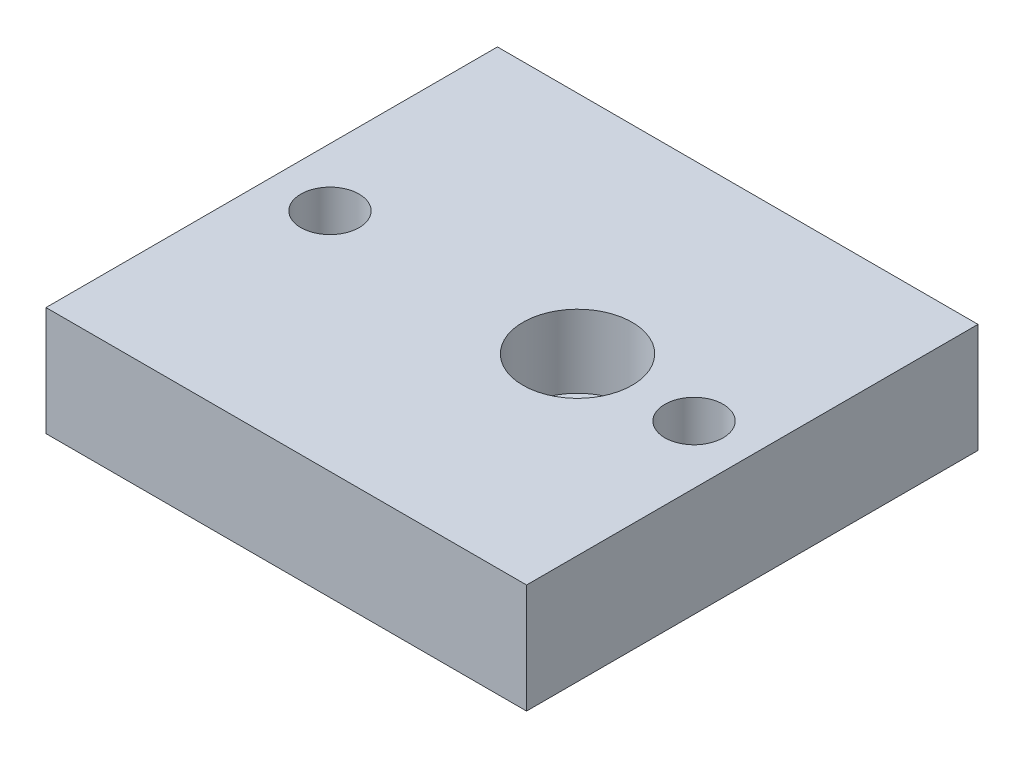
ISO-10303-21;
HEADER;
FILE_DESCRIPTION(('STEP AP214'),'2;1');
FILE_NAME('part.step','',(''),(''),'','','');
FILE_SCHEMA(('AUTOMOTIVE_DESIGN { 1 0 10303 214 1 1 1 1 }'));
ENDSEC;
DATA;
#1=APPLICATION_CONTEXT('core data for automotive mechanical design processes');
#2=APPLICATION_PROTOCOL_DEFINITION('international standard','automotive_design',2000,#1);
#3=PRODUCT_CONTEXT('',#1,'mechanical');
#4=PRODUCT('Part','Part','',(#3));
#5=PRODUCT_RELATED_PRODUCT_CATEGORY('part','',(#4));
#6=PRODUCT_DEFINITION_FORMATION('','',#4);
#7=PRODUCT_DEFINITION_CONTEXT('part definition',#1,'design');
#8=PRODUCT_DEFINITION('design','',#6,#7);
#9=PRODUCT_DEFINITION_SHAPE('','',#8);
#10=(LENGTH_UNIT() NAMED_UNIT(*) SI_UNIT(.MILLI.,.METRE.));
#11=(NAMED_UNIT(*) PLANE_ANGLE_UNIT() SI_UNIT($,.RADIAN.));
#12=(NAMED_UNIT(*) SI_UNIT($,.STERADIAN.) SOLID_ANGLE_UNIT());
#13=UNCERTAINTY_MEASURE_WITH_UNIT(LENGTH_MEASURE(1.E-05),#10,'distance_accuracy_value','');
#14=(GEOMETRIC_REPRESENTATION_CONTEXT(3) GLOBAL_UNCERTAINTY_ASSIGNED_CONTEXT((#13)) GLOBAL_UNIT_ASSIGNED_CONTEXT((#10,
#11,#12)) REPRESENTATION_CONTEXT('',''));
#15=CARTESIAN_POINT('',(0.,0.,0.));
#16=DIRECTION('',(0.,0.,1.));
#17=DIRECTION('',(1.,0.,0.));
#18=AXIS2_PLACEMENT_3D('',#15,#16,#17);
#19=CARTESIAN_POINT('',(9.,0.,0.));
#20=DIRECTION('',(0.,1.,0.));
#21=DIRECTION('',(0.,0.,1.));
#22=AXIS2_PLACEMENT_3D('',#19,#20,#21);
#23=CYLINDRICAL_SURFACE('',#22,5.);
#24=CARTESIAN_POINT('',(9.,0.,0.));
#25=DIRECTION('',(0.,1.,0.));
#26=DIRECTION('',(0.,0.,1.));
#27=AXIS2_PLACEMENT_3D('',#24,#25,#26);
#28=CIRCLE('',#27,5.);
#29=CARTESIAN_POINT('',(9.,0.,5.));
#30=VERTEX_POINT('',#29);
#31=EDGE_CURVE('E114',#30,#30,#28,.T.);
#32=ORIENTED_EDGE('',*,*,#31,.F.);
#33=EDGE_LOOP('',(#32));
#34=FACE_BOUND('',#33,.T.);
#35=CARTESIAN_POINT('',(9.,5.,0.));
#36=DIRECTION('',(0.,1.,0.));
#37=DIRECTION('',(0.,0.,1.));
#38=AXIS2_PLACEMENT_3D('',#35,#36,#37);
#39=CIRCLE('',#38,5.);
#40=CARTESIAN_POINT('',(9.,5.,5.));
#41=VERTEX_POINT('',#40);
#42=EDGE_CURVE('E49',#41,#41,#39,.F.);
#43=ORIENTED_EDGE('',*,*,#42,.F.);
#44=EDGE_LOOP('',(#43));
#45=FACE_BOUND('',#44,.T.);
#46=ADVANCED_FACE('F45',(#34,#45),#23,.F.);
#47=CARTESIAN_POINT('',(33.,15.,31.));
#48=DIRECTION('',(-1.,0.,0.));
#49=DIRECTION('',(0.,0.,1.));
#50=AXIS2_PLACEMENT_3D('',#47,#48,#49);
#51=PLANE('',#50);
#52=DIRECTION('',(0.,0.,-1.));
#53=VECTOR('',#52,1.);
#54=CARTESIAN_POINT('',(33.,0.,31.));
#55=LINE('',#54,#53);
#56=CARTESIAN_POINT('',(33.,0.,31.));
#57=VERTEX_POINT('',#56);
#58=CARTESIAN_POINT('',(33.,0.,-31.));
#59=VERTEX_POINT('',#58);
#60=EDGE_CURVE('E111',#57,#59,#55,.T.);
#61=ORIENTED_EDGE('',*,*,#60,.T.);
#62=DIRECTION('',(0.,-1.,0.));
#63=VECTOR('',#62,1.);
#64=CARTESIAN_POINT('',(33.,15.,-31.));
#65=LINE('',#64,#63);
#66=CARTESIAN_POINT('',(33.,15.,-31.));
#67=VERTEX_POINT('',#66);
#68=EDGE_CURVE('E13',#67,#59,#65,.T.);
#69=ORIENTED_EDGE('',*,*,#68,.F.);
#70=DIRECTION('',(0.,0.,-1.));
#71=VECTOR('',#70,1.);
#72=CARTESIAN_POINT('',(33.,15.,31.));
#73=LINE('',#72,#71);
#74=CARTESIAN_POINT('',(33.,15.,31.));
#75=VERTEX_POINT('',#74);
#76=EDGE_CURVE('E98',#75,#67,#73,.T.);
#77=ORIENTED_EDGE('',*,*,#76,.F.);
#78=DIRECTION('',(0.,-1.,0.));
#79=VECTOR('',#78,1.);
#80=CARTESIAN_POINT('',(33.,15.,31.));
#81=LINE('',#80,#79);
#82=EDGE_CURVE('E107',#75,#57,#81,.T.);
#83=ORIENTED_EDGE('',*,*,#82,.T.);
#84=EDGE_LOOP('',(#61,#69,#77,#83));
#85=FACE_BOUND('',#84,.T.);
#86=ADVANCED_FACE('F47',(#85),#51,.F.);
#87=CARTESIAN_POINT('',(-33.,15.,-31.));
#88=DIRECTION('',(0.,0.,1.));
#89=DIRECTION('',(1.,0.,0.));
#90=AXIS2_PLACEMENT_3D('',#87,#88,#89);
#91=PLANE('',#90);
#92=DIRECTION('',(-1.,0.,0.));
#93=VECTOR('',#92,1.);
#94=CARTESIAN_POINT('',(-33.,0.,-31.));
#95=LINE('',#94,#93);
#96=CARTESIAN_POINT('',(-33.,0.,-31.));
#97=VERTEX_POINT('',#96);
#98=EDGE_CURVE('E102',#59,#97,#95,.T.);
#99=ORIENTED_EDGE('',*,*,#98,.T.);
#100=DIRECTION('',(0.,-1.,0.));
#101=VECTOR('',#100,1.);
#102=CARTESIAN_POINT('',(-33.,15.,-31.));
#103=LINE('',#102,#101);
#104=CARTESIAN_POINT('',(-33.,15.,-31.));
#105=VERTEX_POINT('',#104);
#106=EDGE_CURVE('E55',#105,#97,#103,.T.);
#107=ORIENTED_EDGE('',*,*,#106,.F.);
#108=DIRECTION('',(-1.,0.,0.));
#109=VECTOR('',#108,1.);
#110=CARTESIAN_POINT('',(-33.,15.,-31.));
#111=LINE('',#110,#109);
#112=EDGE_CURVE('E93',#67,#105,#111,.T.);
#113=ORIENTED_EDGE('',*,*,#112,.F.);
#114=ORIENTED_EDGE('',*,*,#68,.T.);
#115=EDGE_LOOP('',(#99,#107,#113,#114));
#116=FACE_BOUND('',#115,.T.);
#117=ADVANCED_FACE('F101',(#116),#91,.F.);
#118=CARTESIAN_POINT('',(-33.,15.,31.));
#119=DIRECTION('',(1.,0.,0.));
#120=DIRECTION('',(0.,0.,-1.));
#121=AXIS2_PLACEMENT_3D('',#118,#119,#120);
#122=PLANE('',#121);
#123=DIRECTION('',(0.,0.,1.));
#124=VECTOR('',#123,1.);
#125=CARTESIAN_POINT('',(-33.,0.,31.));
#126=LINE('',#125,#124);
#127=CARTESIAN_POINT('',(-33.,0.,31.));
#128=VERTEX_POINT('',#127);
#129=EDGE_CURVE('E80',#97,#128,#126,.T.);
#130=ORIENTED_EDGE('',*,*,#129,.T.);
#131=DIRECTION('',(0.,-1.,0.));
#132=VECTOR('',#131,1.);
#133=CARTESIAN_POINT('',(-33.,15.,31.));
#134=LINE('',#133,#132);
#135=CARTESIAN_POINT('',(-33.,15.,31.));
#136=VERTEX_POINT('',#135);
#137=EDGE_CURVE('E103',#136,#128,#134,.T.);
#138=ORIENTED_EDGE('',*,*,#137,.F.);
#139=DIRECTION('',(0.,0.,1.));
#140=VECTOR('',#139,1.);
#141=CARTESIAN_POINT('',(-33.,15.,31.));
#142=LINE('',#141,#140);
#143=EDGE_CURVE('E96',#105,#136,#142,.T.);
#144=ORIENTED_EDGE('',*,*,#143,.F.);
#145=ORIENTED_EDGE('',*,*,#106,.T.);
#146=EDGE_LOOP('',(#130,#138,#144,#145));
#147=FACE_BOUND('',#146,.T.);
#148=ADVANCED_FACE('F105',(#147),#122,.F.);
#149=CARTESIAN_POINT('',(-33.,15.,31.));
#150=DIRECTION('',(0.,0.,-1.));
#151=DIRECTION('',(-1.,0.,0.));
#152=AXIS2_PLACEMENT_3D('',#149,#150,#151);
#153=PLANE('',#152);
#154=DIRECTION('',(1.,0.,0.));
#155=VECTOR('',#154,1.);
#156=CARTESIAN_POINT('',(-33.,0.,31.));
#157=LINE('',#156,#155);
#158=EDGE_CURVE('E86',#128,#57,#157,.T.);
#159=ORIENTED_EDGE('',*,*,#158,.T.);
#160=ORIENTED_EDGE('',*,*,#82,.F.);
#161=DIRECTION('',(1.,0.,0.));
#162=VECTOR('',#161,1.);
#163=CARTESIAN_POINT('',(-33.,15.,31.));
#164=LINE('',#163,#162);
#165=EDGE_CURVE('E63',#136,#75,#164,.T.);
#166=ORIENTED_EDGE('',*,*,#165,.F.);
#167=ORIENTED_EDGE('',*,*,#137,.T.);
#168=EDGE_LOOP('',(#159,#160,#166,#167));
#169=FACE_BOUND('',#168,.T.);
#170=ADVANCED_FACE('F119',(#169),#153,.F.);
#171=CARTESIAN_POINT('',(0.,15.,0.));
#172=DIRECTION('',(0.,-1.,0.));
#173=DIRECTION('',(0.,0.,-1.));
#174=AXIS2_PLACEMENT_3D('',#171,#172,#173);
#175=PLANE('',#174);
#176=CARTESIAN_POINT('',(9.,15.,0.));
#177=DIRECTION('',(0.,1.,0.));
#178=DIRECTION('',(0.,0.,1.));
#179=AXIS2_PLACEMENT_3D('',#176,#177,#178);
#180=CIRCLE('',#179,7.5);
#181=CARTESIAN_POINT('',(9.,15.,7.5));
#182=VERTEX_POINT('',#181);
#183=EDGE_CURVE('E139',#182,#182,#180,.T.);
#184=ORIENTED_EDGE('',*,*,#183,.F.);
#185=EDGE_LOOP('',(#184));
#186=FACE_BOUND('',#185,.T.);
#187=CARTESIAN_POINT('',(25.,15.,0.));
#188=DIRECTION('',(0.,1.,0.));
#189=DIRECTION('',(0.,0.,1.));
#190=AXIS2_PLACEMENT_3D('',#187,#188,#189);
#191=CIRCLE('',#190,4.);
#192=CARTESIAN_POINT('',(25.,15.,4.));
#193=VERTEX_POINT('',#192);
#194=EDGE_CURVE('E134',#193,#193,#191,.T.);
#195=ORIENTED_EDGE('',*,*,#194,.F.);
#196=EDGE_LOOP('',(#195));
#197=FACE_BOUND('',#196,.T.);
#198=CARTESIAN_POINT('',(-25.,15.,0.));
#199=DIRECTION('',(0.,1.,0.));
#200=DIRECTION('',(0.,0.,1.));
#201=AXIS2_PLACEMENT_3D('',#198,#199,#200);
#202=CIRCLE('',#201,4.);
#203=CARTESIAN_POINT('',(-25.,15.,4.));
#204=VERTEX_POINT('',#203);
#205=EDGE_CURVE('E128',#204,#204,#202,.T.);
#206=ORIENTED_EDGE('',*,*,#205,.F.);
#207=EDGE_LOOP('',(#206));
#208=FACE_BOUND('',#207,.T.);
#209=ORIENTED_EDGE('',*,*,#76,.T.);
#210=ORIENTED_EDGE('',*,*,#112,.T.);
#211=ORIENTED_EDGE('',*,*,#143,.T.);
#212=ORIENTED_EDGE('',*,*,#165,.T.);
#213=EDGE_LOOP('',(#209,#210,#211,#212));
#214=FACE_BOUND('',#213,.T.);
#215=ADVANCED_FACE('F94',(#186,#197,#208,#214),#175,.F.);
#216=CARTESIAN_POINT('',(0.,0.,0.));
#217=DIRECTION('',(0.,-1.,0.));
#218=DIRECTION('',(0.,0.,-1.));
#219=AXIS2_PLACEMENT_3D('',#216,#217,#218);
#220=PLANE('',#219);
#221=CARTESIAN_POINT('',(25.,0.,0.));
#222=DIRECTION('',(0.,1.,0.));
#223=DIRECTION('',(0.,0.,1.));
#224=AXIS2_PLACEMENT_3D('',#221,#222,#223);
#225=CIRCLE('',#224,4.);
#226=CARTESIAN_POINT('',(25.,0.,4.));
#227=VERTEX_POINT('',#226);
#228=EDGE_CURVE('E131',#227,#227,#225,.T.);
#229=ORIENTED_EDGE('',*,*,#228,.T.);
#230=EDGE_LOOP('',(#229));
#231=FACE_BOUND('',#230,.T.);
#232=CARTESIAN_POINT('',(-25.,0.,0.));
#233=DIRECTION('',(0.,1.,0.));
#234=DIRECTION('',(0.,0.,1.));
#235=AXIS2_PLACEMENT_3D('',#232,#233,#234);
#236=CIRCLE('',#235,4.);
#237=CARTESIAN_POINT('',(-25.,0.,4.));
#238=VERTEX_POINT('',#237);
#239=EDGE_CURVE('E127',#238,#238,#236,.T.);
#240=ORIENTED_EDGE('',*,*,#239,.T.);
#241=EDGE_LOOP('',(#240));
#242=FACE_BOUND('',#241,.T.);
#243=ORIENTED_EDGE('',*,*,#31,.T.);
#244=EDGE_LOOP('',(#243));
#245=FACE_BOUND('',#244,.T.);
#246=ORIENTED_EDGE('',*,*,#60,.F.);
#247=ORIENTED_EDGE('',*,*,#158,.F.);
#248=ORIENTED_EDGE('',*,*,#129,.F.);
#249=ORIENTED_EDGE('',*,*,#98,.F.);
#250=EDGE_LOOP('',(#246,#247,#248,#249));
#251=FACE_BOUND('',#250,.T.);
#252=ADVANCED_FACE('F122',(#231,#242,#245,#251),#220,.T.);
#253=CARTESIAN_POINT('',(-25.,0.,0.));
#254=DIRECTION('',(0.,1.,0.));
#255=DIRECTION('',(0.,0.,1.));
#256=AXIS2_PLACEMENT_3D('',#253,#254,#255);
#257=CYLINDRICAL_SURFACE('',#256,4.);
#258=ORIENTED_EDGE('',*,*,#239,.F.);
#259=EDGE_LOOP('',(#258));
#260=FACE_BOUND('',#259,.T.);
#261=ORIENTED_EDGE('',*,*,#205,.T.);
#262=EDGE_LOOP('',(#261));
#263=FACE_BOUND('',#262,.T.);
#264=ADVANCED_FACE('F160',(#260,#263),#257,.F.);
#265=CARTESIAN_POINT('',(25.,0.,0.));
#266=DIRECTION('',(0.,1.,0.));
#267=DIRECTION('',(0.,0.,1.));
#268=AXIS2_PLACEMENT_3D('',#265,#266,#267);
#269=CYLINDRICAL_SURFACE('',#268,4.);
#270=ORIENTED_EDGE('',*,*,#228,.F.);
#271=EDGE_LOOP('',(#270));
#272=FACE_BOUND('',#271,.T.);
#273=ORIENTED_EDGE('',*,*,#194,.T.);
#274=EDGE_LOOP('',(#273));
#275=FACE_BOUND('',#274,.T.);
#276=ADVANCED_FACE('F199',(#272,#275),#269,.F.);
#277=CARTESIAN_POINT('',(9.,5.,0.));
#278=DIRECTION('',(0.,1.,0.));
#279=DIRECTION('',(0.,0.,1.));
#280=AXIS2_PLACEMENT_3D('',#277,#278,#279);
#281=PLANE('',#280);
#282=CARTESIAN_POINT('',(9.,5.,0.));
#283=DIRECTION('',(0.,1.,0.));
#284=DIRECTION('',(0.,0.,1.));
#285=AXIS2_PLACEMENT_3D('',#282,#283,#284);
#286=CIRCLE('',#285,7.5);
#287=CARTESIAN_POINT('',(9.,5.,7.5));
#288=VERTEX_POINT('',#287);
#289=EDGE_CURVE('E142',#288,#288,#286,.T.);
#290=ORIENTED_EDGE('',*,*,#289,.T.);
#291=EDGE_LOOP('',(#290));
#292=FACE_BOUND('',#291,.T.);
#293=ORIENTED_EDGE('',*,*,#42,.T.);
#294=EDGE_LOOP('',(#293));
#295=FACE_BOUND('',#294,.T.);
#296=ADVANCED_FACE('F149',(#292,#295),#281,.T.);
#297=CARTESIAN_POINT('',(9.,5.,0.));
#298=DIRECTION('',(0.,1.,0.));
#299=DIRECTION('',(0.,0.,1.));
#300=AXIS2_PLACEMENT_3D('',#297,#298,#299);
#301=CYLINDRICAL_SURFACE('',#300,7.5);
#302=ORIENTED_EDGE('',*,*,#289,.F.);
#303=EDGE_LOOP('',(#302));
#304=FACE_BOUND('',#303,.T.);
#305=ORIENTED_EDGE('',*,*,#183,.T.);
#306=EDGE_LOOP('',(#305));
#307=FACE_BOUND('',#306,.T.);
#308=ADVANCED_FACE('F211',(#304,#307),#301,.F.);
#309=CLOSED_SHELL('',(#46,#86,#117,#148,#170,#215,#252,#264,#276,#296,#308));
#310=MANIFOLD_SOLID_BREP('B2',#309);
#311=ADVANCED_BREP_SHAPE_REPRESENTATION('',(#18,#310),#14);
#312=SHAPE_DEFINITION_REPRESENTATION(#9,#311);
ENDSEC;
END-ISO-10303-21;
